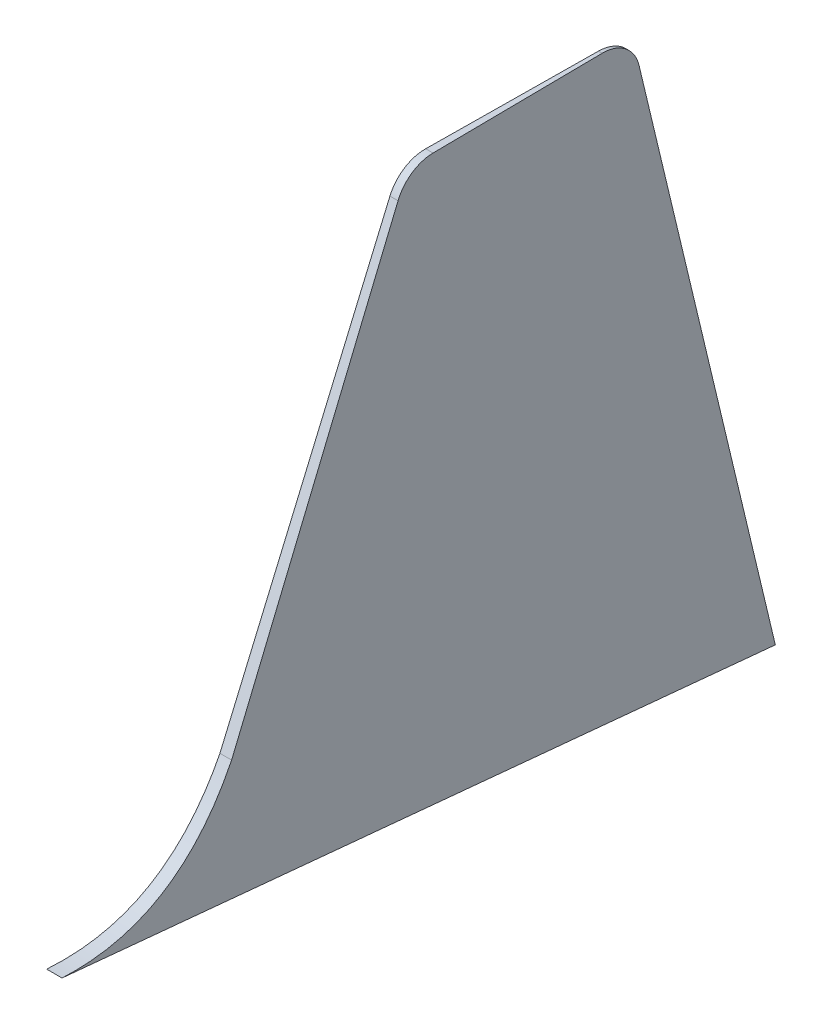
ISO-10303-21;
HEADER;
FILE_DESCRIPTION(('STEP AP214'),'2;1');
FILE_NAME('part.step','',(''),(''),'','','');
FILE_SCHEMA(('AUTOMOTIVE_DESIGN { 1 0 10303 214 1 1 1 1 }'));
ENDSEC;
DATA;
#1=APPLICATION_CONTEXT('core data for automotive mechanical design processes');
#2=APPLICATION_PROTOCOL_DEFINITION('international standard','automotive_design',2000,#1);
#3=PRODUCT_CONTEXT('',#1,'mechanical');
#4=PRODUCT('Part','Part','',(#3));
#5=PRODUCT_RELATED_PRODUCT_CATEGORY('part','',(#4));
#6=PRODUCT_DEFINITION_FORMATION('','',#4);
#7=PRODUCT_DEFINITION_CONTEXT('part definition',#1,'design');
#8=PRODUCT_DEFINITION('design','',#6,#7);
#9=PRODUCT_DEFINITION_SHAPE('','',#8);
#10=(LENGTH_UNIT() NAMED_UNIT(*) SI_UNIT(.MILLI.,.METRE.));
#11=(NAMED_UNIT(*) PLANE_ANGLE_UNIT() SI_UNIT($,.RADIAN.));
#12=(NAMED_UNIT(*) SI_UNIT($,.STERADIAN.) SOLID_ANGLE_UNIT());
#13=UNCERTAINTY_MEASURE_WITH_UNIT(LENGTH_MEASURE(1.E-05),#10,'distance_accuracy_value','');
#14=(GEOMETRIC_REPRESENTATION_CONTEXT(3) GLOBAL_UNCERTAINTY_ASSIGNED_CONTEXT((#13)) GLOBAL_UNIT_ASSIGNED_CONTEXT((#10,
#11,#12)) REPRESENTATION_CONTEXT('',''));
#15=CARTESIAN_POINT('',(0.,0.,0.));
#16=DIRECTION('',(0.,0.,1.));
#17=DIRECTION('',(1.,0.,0.));
#18=AXIS2_PLACEMENT_3D('',#15,#16,#17);
#19=CARTESIAN_POINT('',(30.,659.690974975492,-274.508393171475));
#20=CARTESIAN_POINT('',(30.,621.488219506298,-535.267099010356));
#21=CARTESIAN_POINT('',(30.,854.768900430886,-652.446570924641));
#22=B_SPLINE_CURVE_WITH_KNOTS('',2,(#19,#20,#21),.UNSPECIFIED.,.F.,.F.,(3,3),(0.,1.),.UNSPECIFIED.);
#23=DIRECTION('',(-1.,0.,0.));
#24=VECTOR('',#23,1.);
#25=SURFACE_OF_LINEAR_EXTRUSION('',#22,#24);
#26=CARTESIAN_POINT('',(26.4335896467797,854.768900430886,-652.446570924641));
#27=CARTESIAN_POINT('',(26.4533494777382,851.072621976977,-650.589857919956));
#28=CARTESIAN_POINT('',(26.4735573446668,847.397351469685,-648.691045657748));
#29=CARTESIAN_POINT('',(26.514958133581,840.083440280598,-644.800861407556));
#30=CARTESIAN_POINT('',(26.5361535637988,836.444925027741,-642.809253736011));
#31=CARTESIAN_POINT('',(26.5795533459297,829.212273427449,-638.73123606207));
#32=CARTESIAN_POINT('',(26.6017595316261,825.61823411816,-636.644653750024));
#33=CARTESIAN_POINT('',(26.6472036228559,818.482332492057,-632.37454459021));
#34=CARTESIAN_POINT('',(26.6704427303538,814.94053770697,-630.190904801016));
#35=CARTESIAN_POINT('',(26.7179742725959,807.916831250098,-625.72465036802));
#36=CARTESIAN_POINT('',(26.7422673392437,804.434957300986,-623.441976348017));
#37=CARTESIAN_POINT('',(26.7919269691851,797.538731866273,-618.775758255681));
#38=CARTESIAN_POINT('',(26.8172936757285,794.124389480767,-616.392200723031));
#39=CARTESIAN_POINT('',(26.869328862424,787.343440199122,-611.502765785974));
#40=CARTESIAN_POINT('',(26.8960060158026,783.97742038797,-608.996073410416));
#41=CARTESIAN_POINT('',(26.9504859915033,777.329430767837,-603.876916288532));
#42=CARTESIAN_POINT('',(26.9782882391328,774.047419412156,-601.264505542633));
#43=CARTESIAN_POINT('',(27.0350328551376,767.574946843662,-595.932553730741));
#44=CARTESIAN_POINT('',(27.0639745053133,764.384430083888,-593.213080149662));
#45=CARTESIAN_POINT('',(27.123010105877,758.102258099975,-587.665858235855));
#46=CARTESIAN_POINT('',(27.1531033582624,755.010545011494,-584.838175490266));
#47=CARTESIAN_POINT('',(27.2144516125984,748.933094132542,-579.073647348316));
#48=CARTESIAN_POINT('',(27.2457061064696,745.947311086622,-576.136849693151));
#49=CARTESIAN_POINT('',(27.3093841091574,740.088552399794,-570.15340904778));
#50=CARTESIAN_POINT('',(27.3418074663062,737.215562223607,-567.106780308884));
#51=CARTESIAN_POINT('',(27.4017142930753,732.109924719233,-561.477694484968));
#52=CARTESIAN_POINT('',(27.4290030599523,729.857075744573,-558.913532450956));
#53=CARTESIAN_POINT('',(27.4843459978408,725.43519732558,-553.713287939201));
#54=CARTESIAN_POINT('',(27.5124002683116,723.266178862366,-551.077196115875));
#55=CARTESIAN_POINT('',(27.5692564767901,719.016292700236,-545.734758627378));
#56=CARTESIAN_POINT('',(27.5980584350229,716.935427389896,-543.028411061776));
#57=CARTESIAN_POINT('',(27.6563895701219,712.865778185701,-537.547383549755));
#58=CARTESIAN_POINT('',(27.6859187372265,710.876993056846,-534.77270452058));
#59=CARTESIAN_POINT('',(27.7456806155807,706.995059671121,-529.157238631339));
#60=CARTESIAN_POINT('',(27.7759133238381,705.101911007613,-526.316452052432));
#61=CARTESIAN_POINT('',(27.8368957291635,701.4240325792,-520.58630055152));
#62=CARTESIAN_POINT('',(27.8676419362279,699.638791918105,-517.69726356426));
#63=CARTESIAN_POINT('',(27.9297720086517,696.168891019344,-511.859272657685));
#64=CARTESIAN_POINT('',(27.9611558955677,694.484234189498,-508.910316712824));
#65=CARTESIAN_POINT('',(28.0245249310592,691.217922262578,-502.955907864969));
#66=CARTESIAN_POINT('',(28.0565100791917,689.636267089616,-499.950455003603));
#67=CARTESIAN_POINT('',(28.1210422785253,686.577872300832,-493.88675061386));
#68=CARTESIAN_POINT('',(28.153589314653,685.101129875991,-490.828500501847));
#69=CARTESIAN_POINT('',(28.2192034924206,682.253953794568,-484.663129076924));
#70=CARTESIAN_POINT('',(28.252270601102,680.883513433698,-481.556010860932));
#71=CARTESIAN_POINT('',(28.313312719081,678.469955111936,-475.820248519488));
#72=CARTESIAN_POINT('',(28.3412144344878,677.410426675684,-473.198491382105));
#73=CARTESIAN_POINT('',(28.3973260496777,675.365750001414,-467.926018866746));
#74=CARTESIAN_POINT('',(28.4255359601276,674.380604347257,-465.27530248646));
#75=CARTESIAN_POINT('',(28.4822380852853,672.484670866334,-459.947343285056));
#76=CARTESIAN_POINT('',(28.5107303078846,671.573885124769,-457.27009972242));
#77=CARTESIAN_POINT('',(28.5679709917299,669.826406488932,-451.891535385715));
#78=CARTESIAN_POINT('',(28.5967194544321,668.989714015987,-449.190214474827));
#79=CARTESIAN_POINT('',(28.6544473392677,667.38990848604,-443.765870778146));
#80=CARTESIAN_POINT('',(28.6834267626315,666.626795821294,-441.042847876743));
#81=CARTESIAN_POINT('',(28.7415917293385,665.17342433364,-435.577434213609));
#82=CARTESIAN_POINT('',(28.7707772733576,664.483165749798,-432.835043388356));
#83=CARTESIAN_POINT('',(28.8294343520393,663.172257064202,-427.323388909435));
#84=CARTESIAN_POINT('',(28.8589065345124,662.551863107511,-424.554064384889));
#85=CARTESIAN_POINT('',(28.918011588278,661.382393429711,-419.000316369551));
#86=CARTESIAN_POINT('',(28.9476444649289,660.833320102224,-416.215892375265));
#87=CARTESIAN_POINT('',(29.0070448201892,659.805295926905,-410.634396646563));
#88=CARTESIAN_POINT('',(29.0368122868241,659.326338962572,-407.837326037326));
#89=CARTESIAN_POINT('',(29.0964642330916,658.437073119808,-402.232189808063));
#90=CARTESIAN_POINT('',(29.1263487175285,658.026767090826,-399.424123736603));
#91=CARTESIAN_POINT('',(29.1862073881439,657.27338927992,-393.799562858114));
#92=CARTESIAN_POINT('',(29.2161815556221,656.930304355177,-390.983069808244));
#93=CARTESIAN_POINT('',(29.2762066353601,656.309664325061,-385.342872460863));
#94=CARTESIAN_POINT('',(29.3062575479203,656.032109476447,-382.51916813514));
#95=CARTESIAN_POINT('',(29.3640108785616,655.560514122136,-377.092433448449));
#96=CARTESIAN_POINT('',(29.3917087842511,655.361567769517,-374.489827089911));
#97=CARTESIAN_POINT('',(29.4471372117552,655.016402122105,-369.281549630843));
#98=CARTESIAN_POINT('',(29.474867727562,654.870174294355,-366.675879094836));
#99=CARTESIAN_POINT('',(29.5303520175711,654.629038137009,-361.46235257065));
#100=CARTESIAN_POINT('',(29.5581057900665,654.534126323891,-358.854496742857));
#101=CARTESIAN_POINT('',(29.613627314273,654.394219085686,-353.637471544085));
#102=CARTESIAN_POINT('',(29.6413950658948,654.349223346209,-351.028302181482));
#103=CARTESIAN_POINT('',(29.696749670897,654.307888906088,-345.826961380917));
#104=CARTESIAN_POINT('',(29.7243364977423,654.311228231364,-343.234792436288));
#105=CARTESIAN_POINT('',(29.7795056520151,654.364414166678,-338.050877330389));
#106=CARTESIAN_POINT('',(29.8070879793206,654.414261877981,-335.459131180582));
#107=CARTESIAN_POINT('',(29.8622389578565,654.559102971358,-330.276923939852));
#108=CARTESIAN_POINT('',(29.8898076091529,654.654096133767,-327.686462842738));
#109=CARTESIAN_POINT('',(29.9449222487157,654.887875769672,-322.507670157737));
#110=CARTESIAN_POINT('',(29.9724682382489,655.026659601029,-319.919338450816));
#111=CARTESIAN_POINT('',(30.,655.186668482631,-317.332343643398));
#112=B_SPLINE_CURVE_WITH_KNOTS('',3,(#26,#27,#28,#29,#30,#31,#32,#33,#34,#35,#36,#37,#38,#39,
#40,#41,#42,#43,#44,#45,#46,#47,#48,#49,#50,#51,#52,#53,#54,#55,#56,#57,#58,#59,#60,#61,#62,#63,
#64,#65,#66,#67,#68,#69,#70,#71,#72,#73,#74,#75,#76,#77,#78,#79,#80,#81,#82,#83,#84,#85,#86,#87,
#88,#89,#90,#91,#92,#93,#94,#95,#96,#97,#98,#99,#100,#101,#102,#103,#104,#105,#106,#107,#108,
#109,#110,#111),.UNSPECIFIED.,.F.,.F.,(4,2,2,2,2,2,2,2,2,2,2,2,2,2,2,2,2,2,2,2,2,2,2,2,2,2,2,2,
2,2,2,2,2,2,2,2,2,2,2,2,2,2,4),(0.,12.4092810307222,24.8520090263193,37.3182890615065,
49.7994761160916,62.2882526008432,74.7787006778457,87.367440322134,99.9498289169603,
112.524409601736,125.091485757481,137.653126718924,150.21314354999,160.451529815863,
170.691252713216,180.931252886415,191.171115678595,201.410934928066,211.59770222609,
221.784814460351,231.971919189081,242.158751057093,252.3449399358,260.82753011228,
269.310414815889,277.793537314993,286.276708049957,294.759924006634,303.243167799675,
311.756565358227,320.270248564928,328.783188649515,337.296481987403,345.808109173223,
354.319769708437,362.150268702573,369.979499691686,377.808199136526,385.636849273041,
393.413374606701,401.190084084051,408.966755722419,416.74295823987),.UNSPECIFIED.);
#113=CARTESIAN_POINT('',(26.4335896467797,854.768900430886,-652.446570924641));
#114=VERTEX_POINT('',#113);
#115=CARTESIAN_POINT('',(30.,655.186668482632,-317.332343643398));
#116=VERTEX_POINT('',#115);
#117=EDGE_CURVE('E108',#114,#116,#112,.T.);
#118=ORIENTED_EDGE('',*,*,#117,.F.);
#119=DIRECTION('',(-1.,0.,0.));
#120=VECTOR('',#119,1.);
#121=CARTESIAN_POINT('',(30.,854.768900430886,-652.446570924641));
#122=LINE('',#121,#120);
#123=CARTESIAN_POINT('',(3.56641035322028,854.768900430886,-652.446570924641));
#124=VERTEX_POINT('',#123);
#125=EDGE_CURVE('E103',#114,#124,#122,.T.);
#126=ORIENTED_EDGE('',*,*,#125,.T.);
#127=CARTESIAN_POINT('',(-1.21430643318376E-13,655.186668482632,-317.332343643387));
#128=CARTESIAN_POINT('',(0.0359710397335963,654.977615521665,-320.712326873298));
#129=CARTESIAN_POINT('',(0.0719666871901951,654.804787916162,-324.094622343592));
#130=CARTESIAN_POINT('',(0.144044554587605,654.534391735639,-330.867347982175));
#131=CARTESIAN_POINT('',(0.18012682302443,654.436937719791,-334.257782707344));
#132=CARTESIAN_POINT('',(0.252343927456945,654.320688782297,-341.043591616445));
#133=CARTESIAN_POINT('',(0.288478778881534,654.30197651367,-344.438967250138));
#134=CARTESIAN_POINT('',(0.36076647795943,654.346528513931,-351.231409515385));
#135=CARTESIAN_POINT('',(0.396919322051082,654.409846053479,-354.628475812272));
#136=CARTESIAN_POINT('',(0.46920857841808,654.621664491521,-361.421064406652));
#137=CARTESIAN_POINT('',(0.505344981765438,654.770192572773,-364.816585865235));
#138=CARTESIAN_POINT('',(0.577566870950626,655.155519768415,-371.602844368896));
#139=CARTESIAN_POINT('',(0.613652353665581,655.392324079003,-374.993581120536));
#140=CARTESIAN_POINT('',(0.685957314599843,655.958876593242,-381.787645379072));
#141=CARTESIAN_POINT('',(0.722176311093981,656.289169881468,-385.190927621138));
#142=CARTESIAN_POINT('',(0.794491669390391,657.044940166612,-391.985968857541));
#143=CARTESIAN_POINT('',(0.830588062805742,657.470390379062,-395.37773082237));
#144=CARTESIAN_POINT('',(0.902623052911232,658.419151494968,-402.146427538556));
#145=CARTESIAN_POINT('',(0.938561697866094,658.942429968158,-405.52336682506));
#146=CARTESIAN_POINT('',(1.01024634118895,660.089340694018,-412.259143551756));
#147=CARTESIAN_POINT('',(1.04599239445474,660.712942594316,-415.617986150367));
#148=CARTESIAN_POINT('',(1.11725735632057,662.062794537134,-422.314327923357));
#149=CARTESIAN_POINT('',(1.15277630809483,662.789024423586,-425.65183115456));
#150=CARTESIAN_POINT('',(1.2235529730059,664.346213337499,-432.302290586353));
#151=CARTESIAN_POINT('',(1.25881069041611,665.177170647756,-435.615247188488));
#152=CARTESIAN_POINT('',(1.32878863853232,666.939555802028,-442.190655985323));
#153=CARTESIAN_POINT('',(1.36351088606107,667.870275933563,-445.453297688783));
#154=CARTESIAN_POINT('',(1.43261754365363,669.837989944548,-451.946836531897));
#155=CARTESIAN_POINT('',(1.46700191217956,670.874996715797,-455.177729768486));
#156=CARTESIAN_POINT('',(1.53538554942792,673.055965465212,-461.603330718884));
#157=CARTESIAN_POINT('',(1.56938480824953,674.199930186203,-464.798037502373));
#158=CARTESIAN_POINT('',(1.6369527087926,676.595036697434,-471.146988558738));
#159=CARTESIAN_POINT('',(1.67052135676333,677.846176930255,-474.30123341882));
#160=CARTESIAN_POINT('',(1.73718432456846,680.455381591512,-480.565153364016));
#161=CARTESIAN_POINT('',(1.77027865088188,681.813444557779,-483.674829057926));
#162=CARTESIAN_POINT('',(1.8358070972724,684.629562032517,-489.832144818651));
#163=CARTESIAN_POINT('',(1.8682434715787,686.087153303209,-492.879996701889));
#164=CARTESIAN_POINT('',(1.93256461367274,689.106334212532,-498.923869306518));
#165=CARTESIAN_POINT('',(1.96444936522986,690.667926904704,-501.919888502814));
#166=CARTESIAN_POINT('',(2.02762833147724,693.893296458399,-507.856437681823));
#167=CARTESIAN_POINT('',(2.05892254280751,695.557073901091,-510.796967348817));
#168=CARTESIAN_POINT('',(2.12088436247975,698.984503657457,-516.619148551733));
#169=CARTESIAN_POINT('',(2.15155198283603,700.74815405371,-519.500801216566));
#170=CARTESIAN_POINT('',(2.21222778947061,704.372561778534,-525.202143474238));
#171=CARTESIAN_POINT('',(2.242236017513,706.233312931673,-528.021836991397));
#172=CARTESIAN_POINT('',(2.29656412418367,709.727178822699,-533.126723889832));
#173=CARTESIAN_POINT('',(2.32098997020435,711.345772597726,-535.421874392499));
#174=CARTESIAN_POINT('',(2.36935501851443,714.6461107826,-539.966448400147));
#175=CARTESIAN_POINT('',(2.39329420430404,716.327857328101,-542.215870354742));
#176=CARTESIAN_POINT('',(2.44067337071669,719.752375936203,-546.667806943381));
#177=CARTESIAN_POINT('',(2.46411334460726,721.495148820979,-548.870320944817));
#178=CARTESIAN_POINT('',(2.51048421165437,725.039517056482,-553.227513679192));
#179=CARTESIAN_POINT('',(2.5334151017845,726.841112756743,-555.382192127759));
#180=CARTESIAN_POINT('',(2.57875967455327,730.500812708047,-559.642950133659));
#181=CARTESIAN_POINT('',(2.60117336455062,732.358916154229,-561.749030382444));
#182=CARTESIAN_POINT('',(2.64547829560656,736.129320876385,-565.912099481364));
#183=CARTESIAN_POINT('',(2.66736953508835,738.041622315894,-567.969088183336));
#184=CARTESIAN_POINT('',(2.71071999916205,741.926487012196,-572.042471734734));
#185=CARTESIAN_POINT('',(2.73217693207547,743.899276094559,-574.058651248853));
#186=CARTESIAN_POINT('',(2.77455861009747,747.894736008762,-578.041003775505));
#187=CARTESIAN_POINT('',(2.79548333771296,749.917408475929,-580.007175144317));
#188=CARTESIAN_POINT('',(2.85745582883819,756.056367643224,-585.830359079775));
#189=CARTESIAN_POINT('',(2.8977070190958,760.24405590423,-589.612522427341));
#190=CARTESIAN_POINT('',(2.97609232113758,768.789820473064,-596.977919934171));
#191=CARTESIAN_POINT('',(3.01422660033377,773.147883260549,-600.561169824139));
#192=CARTESIAN_POINT('',(3.07645052489328,780.585538638646,-606.407979453978));
#193=CARTESIAN_POINT('',(3.10110133132808,783.62387732868,-608.724268139826));
#194=CARTESIAN_POINT('',(3.1494688359433,789.765156986682,-613.269072951762));
#195=CARTESIAN_POINT('',(3.173185609064,792.868092741172,-615.497596119538));
#196=CARTESIAN_POINT('',(3.21970797947993,799.133916312566,-619.869024718367));
#197=CARTESIAN_POINT('',(3.24251352152611,802.296807747563,-622.011924957997));
#198=CARTESIAN_POINT('',(3.28723663251635,808.677995104684,-626.214287921523));
#199=CARTESIAN_POINT('',(3.30915410626699,811.896296913922,-628.273741700662));
#200=CARTESIAN_POINT('',(3.35192761666536,818.354152846169,-632.292912369655));
#201=CARTESIAN_POINT('',(3.3727914722409,821.593250088959,-634.25336395734));
#202=CARTESIAN_POINT('',(3.41369127882318,828.116987083294,-638.096473897394));
#203=CARTESIAN_POINT('',(3.433727278466,831.401624144214,-639.979136819805));
#204=CARTESIAN_POINT('',(3.47299269254182,838.01203888507,-643.668672681828));
#205=CARTESIAN_POINT('',(3.49222231396533,841.337805719972,-645.475565071098));
#206=CARTESIAN_POINT('',(3.52989602037208,848.026166154226,-649.015537693687));
#207=CARTESIAN_POINT('',(3.54834051450124,851.388739395392,-650.748656371998));
#208=CARTESIAN_POINT('',(3.56641035322028,854.768900430886,-652.446570924641));
#209=B_SPLINE_CURVE_WITH_KNOTS('',3,(#127,#128,#129,#130,#131,#132,#133,#134,#135,#136,#137,
#138,#139,#140,#141,#142,#143,#144,#145,#146,#147,#148,#149,#150,#151,#152,#153,#154,#155,#156,
#157,#158,#159,#160,#161,#162,#163,#164,#165,#166,#167,#168,#169,#170,#171,#172,#173,#174,#175,
#176,#177,#178,#179,#180,#181,#182,#183,#184,#185,#186,#187,#188,#189,#190,#191,#192,#193,#194,
#195,#196,#197,#198,#199,#200,#201,#202,#203,#204,#205,#206,#207,#208),.UNSPECIFIED.,.F.,.F.,(4,
2,2,2,2,2,2,2,2,2,2,2,2,2,2,2,2,2,2,2,2,2,2,2,2,2,2,2,2,2,2,2,2,2,2,2,2,2,2,2,4),(0.,
10.1598111558622,20.3350338735377,30.5209345788979,40.7134533875429,50.9092254904101,
61.1055978412848,71.3626897310767,81.6168981125352,91.8677132113937,102.115432787471,
112.36114250817,122.606684252887,132.783832612584,142.962216850768,153.140862174705,
163.319359613,173.497717884533,183.631565799403,193.76571138105,203.899914605467,
214.033923333293,224.167288340178,232.591995047007,241.016986911373,249.442092324805,
257.867247810451,266.292283349356,274.717344312441,283.179029610559,291.64099267798,
308.562924829023,325.483516828168,336.943965024514,348.403491833792,359.863712397079,
371.325158166929,382.682739550675,394.039652731064,405.393632615741,416.74162140348),.UNSPECIFIED.);
#210=CARTESIAN_POINT('',(0.,655.186668482632,-317.332343643398));
#211=VERTEX_POINT('',#210);
#212=EDGE_CURVE('E51',#211,#124,#209,.T.);
#213=ORIENTED_EDGE('',*,*,#212,.F.);
#214=DIRECTION('',(-1.,0.,0.));
#215=VECTOR('',#214,1.);
#216=CARTESIAN_POINT('',(30.,655.186668482819,-317.332343643398));
#217=LINE('',#216,#215);
#218=EDGE_CURVE('E12',#116,#211,#217,.T.);
#219=ORIENTED_EDGE('',*,*,#218,.F.);
#220=EDGE_LOOP('',(#118,#126,#213,#219));
#221=FACE_BOUND('',#220,.T.);
#222=ADVANCED_FACE('F35',(#221),#25,.T.);
#223=CARTESIAN_POINT('',(30.,681.029903632865,-71.632051289835));
#224=DIRECTION('',(0.,0.994513858152623,-0.104604904007335));
#225=DIRECTION('',(0.,0.104604904007335,0.994513858152623));
#226=AXIS2_PLACEMENT_3D('',#223,#224,#225);
#227=PLANE('',#226);
#228=DIRECTION('',(0.0105833939235128,-0.104599045538368,-0.99445815972595));
#229=VECTOR('',#228,1.);
#230=CARTESIAN_POINT('',(-2.61118084359804,680.993798590829,-71.9753140172852));
#231=LINE('',#230,#229);
#232=CARTESIAN_POINT('',(15.,506.936901497411,-1726.79253228372));
#233=VERTEX_POINT('',#232);
#234=EDGE_CURVE('E91',#211,#233,#231,.T.);
#235=ORIENTED_EDGE('',*,*,#234,.T.);
#236=DIRECTION('',(0.0105833939235128,0.104599045538368,0.99445815972595));
#237=VECTOR('',#236,1.);
#238=CARTESIAN_POINT('',(32.6145410904063,681.027008977918,-71.6595717439402));
#239=LINE('',#238,#237);
#240=EDGE_CURVE('E107',#233,#116,#239,.T.);
#241=ORIENTED_EDGE('',*,*,#240,.T.);
#242=ORIENTED_EDGE('',*,*,#218,.T.);
#243=EDGE_LOOP('',(#235,#241,#242));
#244=FACE_BOUND('',#243,.T.);
#245=ADVANCED_FACE('F106',(#244),#227,.F.);
#246=CARTESIAN_POINT('',(30.,421.233350346459,-1747.45186754689));
#247=DIRECTION('',(0.,-0.234343305309219,0.972153905128581));
#248=DIRECTION('',(0.,-0.972153905128581,-0.234343305309219));
#249=AXIS2_PLACEMENT_3D('',#246,#247,#248);
#250=PLANE('',#249);
#251=DIRECTION('',(-1.,0.,0.));
#252=VECTOR('',#251,1.);
#253=CARTESIAN_POINT('',(30.,1623.9937311448,-1457.51954135418));
#254=LINE('',#253,#252);
#255=CARTESIAN_POINT('',(17.8657034065216,1623.9937311448,-1457.51954135418));
#256=VERTEX_POINT('',#255);
#257=CARTESIAN_POINT('',(12.1342965934784,1623.9937311448,-1457.51954135418));
#258=VERTEX_POINT('',#257);
#259=EDGE_CURVE('E44',#256,#258,#254,.T.);
#260=ORIENTED_EDGE('',*,*,#259,.F.);
#261=DIRECTION('',(-0.00249396093349489,-0.972150881802454,-0.23434257651902));
#262=VECTOR('',#261,1.);
#263=CARTESIAN_POINT('',(14.7802303288164,421.270251003742,-1747.44297243064));
#264=LINE('',#263,#262);
#265=EDGE_CURVE('E59',#256,#233,#264,.T.);
#266=ORIENTED_EDGE('',*,*,#265,.T.);
#267=DIRECTION('',(-0.00249396093349489,0.972150881802454,0.23434257651902));
#268=VECTOR('',#267,1.);
#269=CARTESIAN_POINT('',(15.2199562664177,421.197515814122,-1747.46050566757));
#270=LINE('',#269,#268);
#271=EDGE_CURVE('E94',#233,#258,#270,.T.);
#272=ORIENTED_EDGE('',*,*,#271,.T.);
#273=EDGE_LOOP('',(#260,#266,#272));
#274=FACE_BOUND('',#273,.T.);
#275=ADVANCED_FACE('F145',(#274),#250,.F.);
#276=CARTESIAN_POINT('',(30.,1606.41798324661,-1384.60799846954));
#277=DIRECTION('',(-1.,0.,0.));
#278=DIRECTION('',(0.,0.,1.));
#279=AXIS2_PLACEMENT_3D('',#276,#277,#278);
#280=CYLINDRICAL_SURFACE('',#279,75.);
#281=CARTESIAN_POINT('',(18.6416551872701,1606.41798324661,-1384.60799846954));
#282=DIRECTION('',(-0.999943374766428,0.,0.0106417696238486));
#283=DIRECTION('',(-0.0106417696238486,0.,-0.999943374766428));
#284=AXIS2_PLACEMENT_3D('',#281,#282,#283);
#285=ELLIPSE('',#284,75.0042471330128,75.);
#286=CARTESIAN_POINT('',(18.6416551872701,1681.41798324661,-1384.60799846954));
#287=VERTEX_POINT('',#286);
#288=EDGE_CURVE('E110',#256,#287,#285,.F.);
#289=ORIENTED_EDGE('',*,*,#288,.F.);
#290=ORIENTED_EDGE('',*,*,#259,.T.);
#291=CARTESIAN_POINT('',(11.3583448127299,1606.41798324661,-1384.60799846954));
#292=DIRECTION('',(0.999943374766428,0.,0.0106417696238486));
#293=DIRECTION('',(-0.0106417696238486,0.,0.999943374766428));
#294=AXIS2_PLACEMENT_3D('',#291,#292,#293);
#295=ELLIPSE('',#294,75.0042471330128,75.);
#296=CARTESIAN_POINT('',(11.3583448127299,1681.41798324661,-1384.60799846954));
#297=VERTEX_POINT('',#296);
#298=EDGE_CURVE('E143',#297,#258,#295,.F.);
#299=ORIENTED_EDGE('',*,*,#298,.F.);
#300=DIRECTION('',(-1.,0.,0.));
#301=VECTOR('',#300,1.);
#302=CARTESIAN_POINT('',(30.,1681.41798324661,-1384.60799846954));
#303=LINE('',#302,#301);
#304=EDGE_CURVE('E135',#287,#297,#303,.T.);
#305=ORIENTED_EDGE('',*,*,#304,.F.);
#306=EDGE_LOOP('',(#289,#290,#299,#305));
#307=FACE_BOUND('',#306,.T.);
#308=ADVANCED_FACE('F141',(#307),#280,.T.);
#309=CARTESIAN_POINT('',(30.,1681.41798324661,0.));
#310=DIRECTION('',(0.,-1.,0.));
#311=DIRECTION('',(0.,0.,-1.));
#312=AXIS2_PLACEMENT_3D('',#309,#310,#311);
#313=PLANE('',#312);
#314=DIRECTION('',(-1.,0.,0.));
#315=VECTOR('',#314,1.);
#316=CARTESIAN_POINT('',(30.,1681.41798324661,-1050.44076591469));
#317=LINE('',#316,#315);
#318=CARTESIAN_POINT('',(22.1979872700927,1681.41798324661,-1050.44076591469));
#319=VERTEX_POINT('',#318);
#320=CARTESIAN_POINT('',(7.8020127299073,1681.41798324661,-1050.44076591469));
#321=VERTEX_POINT('',#320);
#322=EDGE_CURVE('E132',#319,#321,#317,.T.);
#323=ORIENTED_EDGE('',*,*,#322,.F.);
#324=DIRECTION('',(-0.0106417696238486,0.,-0.999943374766428));
#325=VECTOR('',#324,1.);
#326=CARTESIAN_POINT('',(30.,1681.41798324661,-317.332343643398));
#327=LINE('',#326,#325);
#328=EDGE_CURVE('E161',#319,#287,#327,.T.);
#329=ORIENTED_EDGE('',*,*,#328,.T.);
#330=ORIENTED_EDGE('',*,*,#304,.T.);
#331=DIRECTION('',(-0.0106417696238486,0.,0.999943374766428));
#332=VECTOR('',#331,1.);
#333=CARTESIAN_POINT('',(15.,1681.41798324661,-1726.79253228372));
#334=LINE('',#333,#332);
#335=EDGE_CURVE('E162',#297,#321,#334,.T.);
#336=ORIENTED_EDGE('',*,*,#335,.T.);
#337=EDGE_LOOP('',(#323,#329,#330,#336));
#338=FACE_BOUND('',#337,.T.);
#339=ADVANCED_FACE('F160',(#338),#313,.F.);
#340=CARTESIAN_POINT('',(30.,1606.41798324661,-1050.44076591469));
#341=DIRECTION('',(-1.,0.,0.));
#342=DIRECTION('',(0.,0.,1.));
#343=AXIS2_PLACEMENT_3D('',#340,#341,#342);
#344=CYLINDRICAL_SURFACE('',#343,75.);
#345=DIRECTION('',(-1.,0.,0.));
#346=VECTOR('',#345,1.);
#347=CARTESIAN_POINT('',(30.,1635.53228053148,-981.322333542359));
#348=LINE('',#347,#346);
#349=CARTESIAN_POINT('',(22.9335713567813,1635.53228053148,-981.322333542358));
#350=VERTEX_POINT('',#349);
#351=CARTESIAN_POINT('',(7.0664286432187,1635.53228053148,-981.322333542358));
#352=VERTEX_POINT('',#351);
#353=EDGE_CURVE('E129',#350,#352,#348,.T.);
#354=ORIENTED_EDGE('',*,*,#353,.F.);
#355=CARTESIAN_POINT('',(22.1979872700927,1606.41798324661,-1050.44076591469));
#356=DIRECTION('',(-0.999943374766428,0.,0.0106417696238486));
#357=DIRECTION('',(-0.0106417696238486,0.,-0.999943374766428));
#358=AXIS2_PLACEMENT_3D('',#355,#356,#357);
#359=ELLIPSE('',#358,75.0042471330128,75.);
#360=EDGE_CURVE('E112',#350,#319,#359,.T.);
#361=ORIENTED_EDGE('',*,*,#360,.T.);
#362=ORIENTED_EDGE('',*,*,#322,.T.);
#363=CARTESIAN_POINT('',(7.8020127299073,1606.41798324661,-1050.44076591469));
#364=DIRECTION('',(0.999943374766428,0.,0.0106417696238486));
#365=DIRECTION('',(-0.0106417696238486,0.,0.999943374766428));
#366=AXIS2_PLACEMENT_3D('',#363,#364,#365);
#367=ELLIPSE('',#366,75.0042471330128,75.);
#368=EDGE_CURVE('E104',#321,#352,#367,.T.);
#369=ORIENTED_EDGE('',*,*,#368,.T.);
#370=EDGE_LOOP('',(#354,#361,#362,#369));
#371=FACE_BOUND('',#370,.T.);
#372=ADVANCED_FACE('F155',(#371),#344,.T.);
#373=CARTESIAN_POINT('',(30.,-104.604892314525,-248.335932841247));
#374=DIRECTION('',(0.,-0.388190630464965,-0.921579098297706));
#375=DIRECTION('',(0.,0.921579098297706,-0.388190630464965));
#376=AXIS2_PLACEMENT_3D('',#373,#374,#375);
#377=PLANE('',#376);
#378=ORIENTED_EDGE('',*,*,#125,.F.);
#379=DIRECTION('',(-0.00413123393909775,0.921571233925666,-0.388187317807868));
#380=VECTOR('',#379,1.);
#381=CARTESIAN_POINT('',(30.7342729555968,-104.602096723461,-248.337110409466));
#382=LINE('',#381,#380);
#383=EDGE_CURVE('E147',#114,#350,#382,.T.);
#384=ORIENTED_EDGE('',*,*,#383,.T.);
#385=ORIENTED_EDGE('',*,*,#353,.T.);
#386=DIRECTION('',(-0.00413123393909775,-0.921571233925666,0.388187317807868));
#387=VECTOR('',#386,1.);
#388=CARTESIAN_POINT('',(-0.733760942781041,-104.487879932695,-248.385221188127));
#389=LINE('',#388,#387);
#390=EDGE_CURVE('E163',#352,#124,#389,.T.);
#391=ORIENTED_EDGE('',*,*,#390,.T.);
#392=EDGE_LOOP('',(#378,#384,#385,#391));
#393=FACE_BOUND('',#392,.T.);
#394=ADVANCED_FACE('F176',(#393),#377,.F.);
#395=CARTESIAN_POINT('',(15.,1681.41798324661,-1726.79253228372));
#396=DIRECTION('',(0.999943374766428,0.,0.0106417696238486));
#397=DIRECTION('',(0.0106417696238486,0.,-0.999943374766428));
#398=AXIS2_PLACEMENT_3D('',#395,#396,#397);
#399=PLANE('',#398);
#400=ORIENTED_EDGE('',*,*,#298,.T.);
#401=ORIENTED_EDGE('',*,*,#271,.F.);
#402=ORIENTED_EDGE('',*,*,#234,.F.);
#403=ORIENTED_EDGE('',*,*,#212,.T.);
#404=ORIENTED_EDGE('',*,*,#390,.F.);
#405=ORIENTED_EDGE('',*,*,#368,.F.);
#406=ORIENTED_EDGE('',*,*,#335,.F.);
#407=EDGE_LOOP('',(#400,#401,#402,#403,#404,#405,#406));
#408=FACE_BOUND('',#407,.T.);
#409=ADVANCED_FACE('F92',(#408),#399,.F.);
#410=CARTESIAN_POINT('',(30.,1681.41798324661,-317.332343643398));
#411=DIRECTION('',(-0.999943374766428,0.,0.0106417696238486));
#412=DIRECTION('',(0.0106417696238486,0.,0.999943374766428));
#413=AXIS2_PLACEMENT_3D('',#410,#411,#412);
#414=PLANE('',#413);
#415=ORIENTED_EDGE('',*,*,#288,.T.);
#416=ORIENTED_EDGE('',*,*,#328,.F.);
#417=ORIENTED_EDGE('',*,*,#360,.F.);
#418=ORIENTED_EDGE('',*,*,#383,.F.);
#419=ORIENTED_EDGE('',*,*,#117,.T.);
#420=ORIENTED_EDGE('',*,*,#240,.F.);
#421=ORIENTED_EDGE('',*,*,#265,.F.);
#422=EDGE_LOOP('',(#415,#416,#417,#418,#419,#420,#421));
#423=FACE_BOUND('',#422,.T.);
#424=ADVANCED_FACE('F175',(#423),#414,.F.);
#425=CLOSED_SHELL('',(#222,#245,#275,#308,#339,#372,#394,#409,#424));
#426=MANIFOLD_SOLID_BREP('B2',#425);
#427=ADVANCED_BREP_SHAPE_REPRESENTATION('',(#18,#426),#14);
#428=SHAPE_DEFINITION_REPRESENTATION(#9,#427);
ENDSEC;
END-ISO-10303-21;
